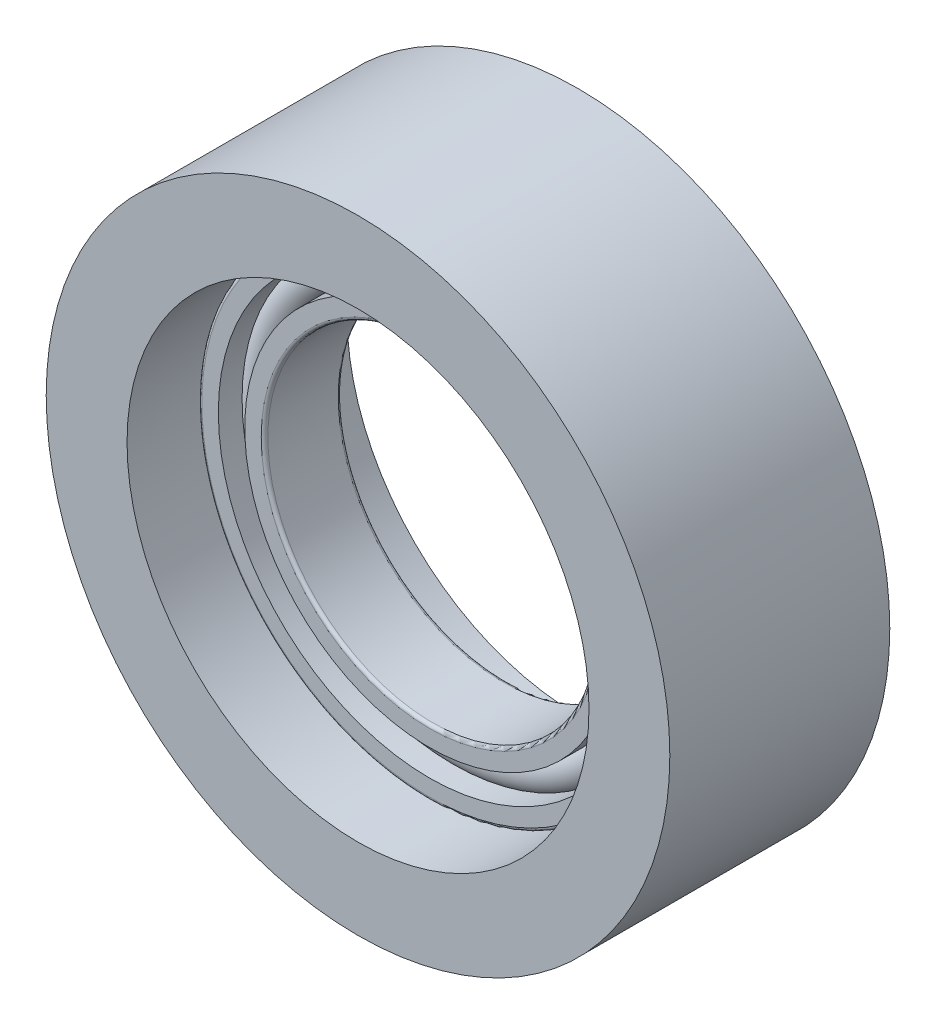
ISO-10303-21;
HEADER;
FILE_DESCRIPTION(('STEP AP214'),'2;1');
FILE_NAME('part.step','',(''),(''),'','','');
FILE_SCHEMA(('AUTOMOTIVE_DESIGN { 1 0 10303 214 1 1 1 1 }'));
ENDSEC;
DATA;
#1=APPLICATION_CONTEXT('core data for automotive mechanical design processes');
#2=APPLICATION_PROTOCOL_DEFINITION('international standard','automotive_design',2000,#1);
#3=PRODUCT_CONTEXT('',#1,'mechanical');
#4=PRODUCT('Part','Part','',(#3));
#5=PRODUCT_RELATED_PRODUCT_CATEGORY('part','',(#4));
#6=PRODUCT_DEFINITION_FORMATION('','',#4);
#7=PRODUCT_DEFINITION_CONTEXT('part definition',#1,'design');
#8=PRODUCT_DEFINITION('design','',#6,#7);
#9=PRODUCT_DEFINITION_SHAPE('','',#8);
#10=(LENGTH_UNIT() NAMED_UNIT(*) SI_UNIT(.MILLI.,.METRE.));
#11=(NAMED_UNIT(*) PLANE_ANGLE_UNIT() SI_UNIT($,.RADIAN.));
#12=(NAMED_UNIT(*) SI_UNIT($,.STERADIAN.) SOLID_ANGLE_UNIT());
#13=UNCERTAINTY_MEASURE_WITH_UNIT(LENGTH_MEASURE(1.E-05),#10,'distance_accuracy_value','');
#14=(GEOMETRIC_REPRESENTATION_CONTEXT(3) GLOBAL_UNCERTAINTY_ASSIGNED_CONTEXT((#13)) GLOBAL_UNIT_ASSIGNED_CONTEXT((#10,
#11,#12)) REPRESENTATION_CONTEXT('',''));
#15=CARTESIAN_POINT('',(0.,0.,0.));
#16=DIRECTION('',(0.,0.,1.));
#17=DIRECTION('',(1.,0.,0.));
#18=AXIS2_PLACEMENT_3D('',#15,#16,#17);
#19=CARTESIAN_POINT('',(0.,0.,10.));
#20=DIRECTION('',(0.,0.,-1.));
#21=DIRECTION('',(-1.,0.,0.));
#22=AXIS2_PLACEMENT_3D('',#19,#20,#21);
#23=TOROIDAL_SURFACE('',#22,18.,1.8);
#24=CARTESIAN_POINT('',(0.,0.,11.3416407864999));
#25=DIRECTION('',(0.,0.,-1.));
#26=DIRECTION('',(-1.,0.,0.));
#27=AXIS2_PLACEMENT_3D('',#24,#25,#26);
#28=CIRCLE('',#27,19.2);
#29=CARTESIAN_POINT('',(-19.2,0.,11.3416407864999));
#30=VERTEX_POINT('',#29);
#31=EDGE_CURVE('P0_E18',#30,#30,#28,.F.);
#32=ORIENTED_EDGE('',*,*,#31,.T.);
#33=EDGE_LOOP('',(#32));
#34=FACE_BOUND('',#33,.T.);
#35=CARTESIAN_POINT('',(0.,0.,11.3416407864999));
#36=DIRECTION('',(0.,0.,-1.));
#37=DIRECTION('',(-1.,0.,0.));
#38=AXIS2_PLACEMENT_3D('',#35,#36,#37);
#39=CIRCLE('',#38,16.8);
#40=CARTESIAN_POINT('',(-16.8,0.,11.3416407864999));
#41=VERTEX_POINT('',#40);
#42=EDGE_CURVE('P0_E9',#41,#41,#39,.T.);
#43=ORIENTED_EDGE('',*,*,#42,.T.);
#44=EDGE_LOOP('',(#43));
#45=FACE_BOUND('',#44,.T.);
#46=ADVANCED_FACE('P0_F14',(#34,#45),#23,.T.);
#47=CARTESIAN_POINT('',(0.,0.,-10.6375));
#48=DIRECTION('',(0.,0.,1.));
#49=DIRECTION('',(1.,0.,0.));
#50=AXIS2_PLACEMENT_3D('',#47,#48,#49);
#51=CYLINDRICAL_SURFACE('',#50,16.8);
#52=CARTESIAN_POINT('',(0.,0.,13.5));
#53=DIRECTION('',(0.,0.,1.));
#54=DIRECTION('',(1.,0.,0.));
#55=AXIS2_PLACEMENT_3D('',#52,#53,#54);
#56=CIRCLE('',#55,16.8);
#57=CARTESIAN_POINT('',(16.8,0.,13.5));
#58=VERTEX_POINT('',#57);
#59=EDGE_CURVE('P0_E27',#58,#58,#56,.T.);
#60=ORIENTED_EDGE('',*,*,#59,.F.);
#61=EDGE_LOOP('',(#60));
#62=FACE_BOUND('',#61,.T.);
#63=ORIENTED_EDGE('',*,*,#42,.F.);
#64=EDGE_LOOP('',(#63));
#65=FACE_BOUND('',#64,.T.);
#66=ADVANCED_FACE('P0_F66',(#62,#65),#51,.T.);
#67=CARTESIAN_POINT('',(0.,0.,-10.6375));
#68=DIRECTION('',(0.,0.,1.));
#69=DIRECTION('',(1.,0.,0.));
#70=AXIS2_PLACEMENT_3D('',#67,#68,#69);
#71=CYLINDRICAL_SURFACE('',#70,16.8);
#72=CARTESIAN_POINT('',(0.,0.,6.5));
#73=DIRECTION('',(0.,0.,1.));
#74=DIRECTION('',(1.,0.,0.));
#75=AXIS2_PLACEMENT_3D('',#72,#73,#74);
#76=CIRCLE('',#75,16.8);
#77=CARTESIAN_POINT('',(16.8,0.,6.5));
#78=VERTEX_POINT('',#77);
#79=EDGE_CURVE('P0_E36',#78,#78,#76,.T.);
#80=ORIENTED_EDGE('',*,*,#79,.T.);
#81=EDGE_LOOP('',(#80));
#82=FACE_BOUND('',#81,.T.);
#83=CARTESIAN_POINT('',(0.,0.,8.65835921350013));
#84=DIRECTION('',(0.,0.,1.));
#85=DIRECTION('',(1.,0.,0.));
#86=AXIS2_PLACEMENT_3D('',#83,#84,#85);
#87=CIRCLE('',#86,16.8);
#88=CARTESIAN_POINT('',(16.8,0.,8.65835921350013));
#89=VERTEX_POINT('',#88);
#90=EDGE_CURVE('P0_E22',#89,#89,#87,.T.);
#91=ORIENTED_EDGE('',*,*,#90,.F.);
#92=EDGE_LOOP('',(#91));
#93=FACE_BOUND('',#92,.T.);
#94=ADVANCED_FACE('P0_F69',(#82,#93),#71,.T.);
#95=CARTESIAN_POINT('',(0.,15.3,13.5));
#96=DIRECTION('',(0.,0.,1.));
#97=DIRECTION('',(1.,0.,0.));
#98=AXIS2_PLACEMENT_3D('',#95,#96,#97);
#99=PLANE('',#98);
#100=ORIENTED_EDGE('',*,*,#59,.T.);
#101=EDGE_LOOP('',(#100));
#102=FACE_BOUND('',#101,.T.);
#103=CARTESIAN_POINT('',(0.,0.,13.5));
#104=DIRECTION('',(0.,0.,1.));
#105=DIRECTION('',(1.,0.,0.));
#106=AXIS2_PLACEMENT_3D('',#103,#104,#105);
#107=CIRCLE('',#106,15.3);
#108=CARTESIAN_POINT('',(15.3,0.,13.5));
#109=VERTEX_POINT('',#108);
#110=EDGE_CURVE('P0_E58',#109,#109,#107,.T.);
#111=ORIENTED_EDGE('',*,*,#110,.F.);
#112=EDGE_LOOP('',(#111));
#113=FACE_BOUND('',#112,.T.);
#114=ADVANCED_FACE('P0_F63',(#102,#113),#99,.T.);
#115=CARTESIAN_POINT('',(0.,0.,13.2));
#116=DIRECTION('',(0.,0.,1.));
#117=DIRECTION('',(1.,0.,0.));
#118=AXIS2_PLACEMENT_3D('',#115,#116,#117);
#119=TOROIDAL_SURFACE('',#118,15.3,0.3);
#120=ORIENTED_EDGE('',*,*,#110,.T.);
#121=EDGE_LOOP('',(#120));
#122=FACE_BOUND('',#121,.T.);
#123=CARTESIAN_POINT('',(0.,0.,13.2));
#124=DIRECTION('',(0.,0.,1.));
#125=DIRECTION('',(1.,0.,0.));
#126=AXIS2_PLACEMENT_3D('',#123,#124,#125);
#127=CIRCLE('',#126,15.);
#128=CARTESIAN_POINT('',(15.,0.,13.2));
#129=VERTEX_POINT('',#128);
#130=EDGE_CURVE('P0_E55',#129,#129,#127,.T.);
#131=ORIENTED_EDGE('',*,*,#130,.F.);
#132=EDGE_LOOP('',(#131));
#133=FACE_BOUND('',#132,.T.);
#134=ADVANCED_FACE('P0_F81',(#122,#133),#119,.T.);
#135=CARTESIAN_POINT('',(0.,0.,-10.6375));
#136=DIRECTION('',(0.,0.,1.));
#137=DIRECTION('',(1.,0.,0.));
#138=AXIS2_PLACEMENT_3D('',#135,#136,#137);
#139=CYLINDRICAL_SURFACE('',#138,15.);
#140=ORIENTED_EDGE('',*,*,#130,.T.);
#141=EDGE_LOOP('',(#140));
#142=FACE_BOUND('',#141,.T.);
#143=CARTESIAN_POINT('',(0.,0.,6.8));
#144=DIRECTION('',(0.,0.,1.));
#145=DIRECTION('',(1.,0.,0.));
#146=AXIS2_PLACEMENT_3D('',#143,#144,#145);
#147=CIRCLE('',#146,15.);
#148=CARTESIAN_POINT('',(15.,0.,6.8));
#149=VERTEX_POINT('',#148);
#150=EDGE_CURVE('P0_E52',#149,#149,#147,.T.);
#151=ORIENTED_EDGE('',*,*,#150,.F.);
#152=EDGE_LOOP('',(#151));
#153=FACE_BOUND('',#152,.T.);
#154=ADVANCED_FACE('P0_F84',(#142,#153),#139,.F.);
#155=CARTESIAN_POINT('',(0.,0.,6.8));
#156=DIRECTION('',(0.,0.,1.));
#157=DIRECTION('',(1.,0.,0.));
#158=AXIS2_PLACEMENT_3D('',#155,#156,#157);
#159=TOROIDAL_SURFACE('',#158,15.3,0.3);
#160=ORIENTED_EDGE('',*,*,#150,.T.);
#161=EDGE_LOOP('',(#160));
#162=FACE_BOUND('',#161,.T.);
#163=CARTESIAN_POINT('',(0.,0.,6.5));
#164=DIRECTION('',(0.,0.,1.));
#165=DIRECTION('',(1.,0.,0.));
#166=AXIS2_PLACEMENT_3D('',#163,#164,#165);
#167=CIRCLE('',#166,15.3);
#168=CARTESIAN_POINT('',(15.3,0.,6.5));
#169=VERTEX_POINT('',#168);
#170=EDGE_CURVE('P0_E49',#169,#169,#167,.T.);
#171=ORIENTED_EDGE('',*,*,#170,.F.);
#172=EDGE_LOOP('',(#171));
#173=FACE_BOUND('',#172,.T.);
#174=ADVANCED_FACE('P0_F88',(#162,#173),#159,.T.);
#175=CARTESIAN_POINT('',(0.,16.8,6.5));
#176=DIRECTION('',(0.,0.,-1.));
#177=DIRECTION('',(-1.,0.,0.));
#178=AXIS2_PLACEMENT_3D('',#175,#176,#177);
#179=PLANE('',#178);
#180=ORIENTED_EDGE('',*,*,#170,.T.);
#181=EDGE_LOOP('',(#180));
#182=FACE_BOUND('',#181,.T.);
#183=ORIENTED_EDGE('',*,*,#79,.F.);
#184=EDGE_LOOP('',(#183));
#185=FACE_BOUND('',#184,.T.);
#186=ADVANCED_FACE('P0_F92',(#182,#185),#179,.T.);
#187=CARTESIAN_POINT('',(0.,0.,8.65835921350013));
#188=DIRECTION('',(0.,0.,1.));
#189=DIRECTION('',(1.,0.,0.));
#190=AXIS2_PLACEMENT_3D('',#187,#188,#189);
#191=CIRCLE('',#190,19.2);
#192=CARTESIAN_POINT('',(19.2,0.,8.65835921350013));
#193=VERTEX_POINT('',#192);
#194=EDGE_CURVE('P0_E30',#193,#193,#191,.F.);
#195=ORIENTED_EDGE('',*,*,#194,.T.);
#196=EDGE_LOOP('',(#195));
#197=FACE_BOUND('',#196,.T.);
#198=ORIENTED_EDGE('',*,*,#90,.T.);
#199=EDGE_LOOP('',(#198));
#200=FACE_BOUND('',#199,.T.);
#201=ADVANCED_FACE('P0_F16',(#197,#200),#23,.T.);
#202=CARTESIAN_POINT('',(0.,0.,-10.6375));
#203=DIRECTION('',(0.,0.,1.));
#204=DIRECTION('',(1.,0.,0.));
#205=AXIS2_PLACEMENT_3D('',#202,#203,#204);
#206=CYLINDRICAL_SURFACE('',#205,19.2);
#207=CARTESIAN_POINT('',(0.,0.,13.5));
#208=DIRECTION('',(0.,0.,1.));
#209=DIRECTION('',(1.,0.,0.));
#210=AXIS2_PLACEMENT_3D('',#207,#208,#209);
#211=CIRCLE('',#210,19.2);
#212=CARTESIAN_POINT('',(19.2,0.,13.5));
#213=VERTEX_POINT('',#212);
#214=EDGE_CURVE('P0_E32',#213,#213,#211,.T.);
#215=ORIENTED_EDGE('',*,*,#214,.T.);
#216=EDGE_LOOP('',(#215));
#217=FACE_BOUND('',#216,.T.);
#218=ORIENTED_EDGE('',*,*,#31,.F.);
#219=EDGE_LOOP('',(#218));
#220=FACE_BOUND('',#219,.T.);
#221=ADVANCED_FACE('P0_F97',(#217,#220),#206,.F.);
#222=CARTESIAN_POINT('',(0.,0.,-10.6375));
#223=DIRECTION('',(0.,0.,1.));
#224=DIRECTION('',(1.,0.,0.));
#225=AXIS2_PLACEMENT_3D('',#222,#223,#224);
#226=CYLINDRICAL_SURFACE('',#225,19.2);
#227=CARTESIAN_POINT('',(0.,0.,6.5));
#228=DIRECTION('',(0.,0.,1.));
#229=DIRECTION('',(1.,0.,0.));
#230=AXIS2_PLACEMENT_3D('',#227,#228,#229);
#231=CIRCLE('',#230,19.2);
#232=CARTESIAN_POINT('',(19.2,0.,6.5));
#233=VERTEX_POINT('',#232);
#234=EDGE_CURVE('P0_E128',#233,#233,#231,.T.);
#235=ORIENTED_EDGE('',*,*,#234,.F.);
#236=EDGE_LOOP('',(#235));
#237=FACE_BOUND('',#236,.T.);
#238=ORIENTED_EDGE('',*,*,#194,.F.);
#239=EDGE_LOOP('',(#238));
#240=FACE_BOUND('',#239,.T.);
#241=ADVANCED_FACE('P0_F100',(#237,#240),#226,.F.);
#242=CARTESIAN_POINT('',(0.,20.7,13.5));
#243=DIRECTION('',(0.,0.,1.));
#244=DIRECTION('',(1.,0.,0.));
#245=AXIS2_PLACEMENT_3D('',#242,#243,#244);
#246=PLANE('',#245);
#247=CARTESIAN_POINT('',(0.,0.,13.5));
#248=DIRECTION('',(0.,0.,1.));
#249=DIRECTION('',(1.,0.,0.));
#250=AXIS2_PLACEMENT_3D('',#247,#248,#249);
#251=CIRCLE('',#250,20.7);
#252=CARTESIAN_POINT('',(20.7,0.,13.5));
#253=VERTEX_POINT('',#252);
#254=EDGE_CURVE('P0_E38',#253,#253,#251,.T.);
#255=ORIENTED_EDGE('',*,*,#254,.T.);
#256=EDGE_LOOP('',(#255));
#257=FACE_BOUND('',#256,.T.);
#258=ORIENTED_EDGE('',*,*,#214,.F.);
#259=EDGE_LOOP('',(#258));
#260=FACE_BOUND('',#259,.T.);
#261=ADVANCED_FACE('P0_F101',(#257,#260),#246,.T.);
#262=CARTESIAN_POINT('',(0.,0.,13.2));
#263=DIRECTION('',(0.,0.,1.));
#264=DIRECTION('',(1.,0.,0.));
#265=AXIS2_PLACEMENT_3D('',#262,#263,#264);
#266=TOROIDAL_SURFACE('',#265,20.7,0.299999999999996);
#267=CARTESIAN_POINT('',(0.,0.,13.2));
#268=DIRECTION('',(0.,0.,1.));
#269=DIRECTION('',(1.,0.,0.));
#270=AXIS2_PLACEMENT_3D('',#267,#268,#269);
#271=CIRCLE('',#270,21.);
#272=CARTESIAN_POINT('',(21.,0.,13.2));
#273=VERTEX_POINT('',#272);
#274=EDGE_CURVE('P0_E43',#273,#273,#271,.T.);
#275=ORIENTED_EDGE('',*,*,#274,.T.);
#276=EDGE_LOOP('',(#275));
#277=FACE_BOUND('',#276,.T.);
#278=ORIENTED_EDGE('',*,*,#254,.F.);
#279=EDGE_LOOP('',(#278));
#280=FACE_BOUND('',#279,.T.);
#281=ADVANCED_FACE('P0_F104',(#277,#280),#266,.T.);
#282=CARTESIAN_POINT('',(0.,0.,-10.6375));
#283=DIRECTION('',(0.,0.,1.));
#284=DIRECTION('',(1.,0.,0.));
#285=AXIS2_PLACEMENT_3D('',#282,#283,#284);
#286=CYLINDRICAL_SURFACE('',#285,21.);
#287=CARTESIAN_POINT('',(0.,0.,6.8));
#288=DIRECTION('',(0.,0.,1.));
#289=DIRECTION('',(1.,0.,0.));
#290=AXIS2_PLACEMENT_3D('',#287,#288,#289);
#291=CIRCLE('',#290,21.);
#292=CARTESIAN_POINT('',(21.,0.,6.8));
#293=VERTEX_POINT('',#292);
#294=EDGE_CURVE('P0_E132',#293,#293,#291,.T.);
#295=ORIENTED_EDGE('',*,*,#294,.T.);
#296=EDGE_LOOP('',(#295));
#297=FACE_BOUND('',#296,.T.);
#298=ORIENTED_EDGE('',*,*,#274,.F.);
#299=EDGE_LOOP('',(#298));
#300=FACE_BOUND('',#299,.T.);
#301=ADVANCED_FACE('P0_F108',(#297,#300),#286,.T.);
#302=CARTESIAN_POINT('',(0.,0.,6.8));
#303=DIRECTION('',(0.,0.,1.));
#304=DIRECTION('',(1.,0.,0.));
#305=AXIS2_PLACEMENT_3D('',#302,#303,#304);
#306=TOROIDAL_SURFACE('',#305,20.7,0.299999999999996);
#307=CARTESIAN_POINT('',(0.,0.,6.5));
#308=DIRECTION('',(0.,0.,1.));
#309=DIRECTION('',(1.,0.,0.));
#310=AXIS2_PLACEMENT_3D('',#307,#308,#309);
#311=CIRCLE('',#310,20.7);
#312=CARTESIAN_POINT('',(20.7,0.,6.5));
#313=VERTEX_POINT('',#312);
#314=EDGE_CURVE('P0_E129',#313,#313,#311,.T.);
#315=ORIENTED_EDGE('',*,*,#314,.T.);
#316=EDGE_LOOP('',(#315));
#317=FACE_BOUND('',#316,.T.);
#318=ORIENTED_EDGE('',*,*,#294,.F.);
#319=EDGE_LOOP('',(#318));
#320=FACE_BOUND('',#319,.T.);
#321=ADVANCED_FACE('P0_F112',(#317,#320),#306,.T.);
#322=CARTESIAN_POINT('',(0.,19.2,6.5));
#323=DIRECTION('',(0.,0.,-1.));
#324=DIRECTION('',(-1.,0.,0.));
#325=AXIS2_PLACEMENT_3D('',#322,#323,#324);
#326=PLANE('',#325);
#327=ORIENTED_EDGE('',*,*,#234,.T.);
#328=EDGE_LOOP('',(#327));
#329=FACE_BOUND('',#328,.T.);
#330=ORIENTED_EDGE('',*,*,#314,.F.);
#331=EDGE_LOOP('',(#330));
#332=FACE_BOUND('',#331,.T.);
#333=ADVANCED_FACE('P0_F116',(#329,#332),#326,.T.);
#334=CLOSED_SHELL('',(#46,#66,#94,#114,#134,#154,#174,#186,#201,#221,#241,#261,#281,#301,#321,#333));
#335=MANIFOLD_SOLID_BREP('P0_B1',#334);
#336=CARTESIAN_POINT('',(0.,0.,20.));
#337=DIRECTION('',(0.,0.,1.));
#338=DIRECTION('',(1.,0.,0.));
#339=AXIS2_PLACEMENT_3D('',#336,#337,#338);
#340=PLANE('',#339);
#341=CARTESIAN_POINT('',(0.,0.,20.));
#342=DIRECTION('',(0.,0.,1.));
#343=DIRECTION('',(1.,0.,0.));
#344=AXIS2_PLACEMENT_3D('',#341,#342,#343);
#345=CIRCLE('',#344,28.35);
#346=CARTESIAN_POINT('',(28.35,0.,20.));
#347=VERTEX_POINT('',#346);
#348=EDGE_CURVE('P1_E10',#347,#347,#345,.T.);
#349=ORIENTED_EDGE('',*,*,#348,.T.);
#350=EDGE_LOOP('',(#349));
#351=FACE_BOUND('',#350,.T.);
#352=CARTESIAN_POINT('',(0.,0.,20.));
#353=DIRECTION('',(0.,0.,1.));
#354=DIRECTION('',(1.,0.,0.));
#355=AXIS2_PLACEMENT_3D('',#352,#353,#354);
#356=CIRCLE('',#355,21.);
#357=CARTESIAN_POINT('',(21.,0.,20.));
#358=VERTEX_POINT('',#357);
#359=EDGE_CURVE('P1_E26',#358,#358,#356,.T.);
#360=ORIENTED_EDGE('',*,*,#359,.F.);
#361=EDGE_LOOP('',(#360));
#362=FACE_BOUND('',#361,.T.);
#363=ADVANCED_FACE('P1_F15',(#351,#362),#340,.T.);
#364=CARTESIAN_POINT('',(0.,0.,0.));
#365=DIRECTION('',(0.,0.,1.));
#366=DIRECTION('',(1.,0.,0.));
#367=AXIS2_PLACEMENT_3D('',#364,#365,#366);
#368=PLANE('',#367);
#369=CARTESIAN_POINT('',(0.,0.,0.));
#370=DIRECTION('',(0.,0.,1.));
#371=DIRECTION('',(1.,0.,0.));
#372=AXIS2_PLACEMENT_3D('',#369,#370,#371);
#373=CIRCLE('',#372,28.35);
#374=CARTESIAN_POINT('',(28.35,0.,0.));
#375=VERTEX_POINT('',#374);
#376=EDGE_CURVE('P1_E19',#375,#375,#373,.T.);
#377=ORIENTED_EDGE('',*,*,#376,.F.);
#378=EDGE_LOOP('',(#377));
#379=FACE_BOUND('',#378,.T.);
#380=CARTESIAN_POINT('',(0.,0.,0.));
#381=DIRECTION('',(0.,0.,1.));
#382=DIRECTION('',(1.,0.,0.));
#383=AXIS2_PLACEMENT_3D('',#380,#381,#382);
#384=CIRCLE('',#383,21.);
#385=CARTESIAN_POINT('',(21.,0.,0.));
#386=VERTEX_POINT('',#385);
#387=EDGE_CURVE('P1_E28',#386,#386,#384,.T.);
#388=ORIENTED_EDGE('',*,*,#387,.T.);
#389=EDGE_LOOP('',(#388));
#390=FACE_BOUND('',#389,.T.);
#391=ADVANCED_FACE('P1_F38',(#379,#390),#368,.F.);
#392=CARTESIAN_POINT('',(0.,0.,20.));
#393=DIRECTION('',(0.,0.,-1.));
#394=DIRECTION('',(-1.,0.,0.));
#395=AXIS2_PLACEMENT_3D('',#392,#393,#394);
#396=CYLINDRICAL_SURFACE('',#395,28.35);
#397=ORIENTED_EDGE('',*,*,#348,.F.);
#398=EDGE_LOOP('',(#397));
#399=FACE_BOUND('',#398,.T.);
#400=ORIENTED_EDGE('',*,*,#376,.T.);
#401=EDGE_LOOP('',(#400));
#402=FACE_BOUND('',#401,.T.);
#403=ADVANCED_FACE('P1_F17',(#399,#402),#396,.T.);
#404=CARTESIAN_POINT('',(0.,0.,20.));
#405=DIRECTION('',(0.,0.,-1.));
#406=DIRECTION('',(-1.,0.,0.));
#407=AXIS2_PLACEMENT_3D('',#404,#405,#406);
#408=CYLINDRICAL_SURFACE('',#407,21.);
#409=ORIENTED_EDGE('',*,*,#359,.T.);
#410=EDGE_LOOP('',(#409));
#411=FACE_BOUND('',#410,.T.);
#412=ORIENTED_EDGE('',*,*,#387,.F.);
#413=EDGE_LOOP('',(#412));
#414=FACE_BOUND('',#413,.T.);
#415=ADVANCED_FACE('P1_F34',(#411,#414),#408,.F.);
#416=CLOSED_SHELL('',(#363,#391,#403,#415));
#417=MANIFOLD_SOLID_BREP('P1_B1',#416);
#418=ADVANCED_BREP_SHAPE_REPRESENTATION('',(#18,#335,#417),#14);
#419=SHAPE_DEFINITION_REPRESENTATION(#9,#418);
ENDSEC;
END-ISO-10303-21;
